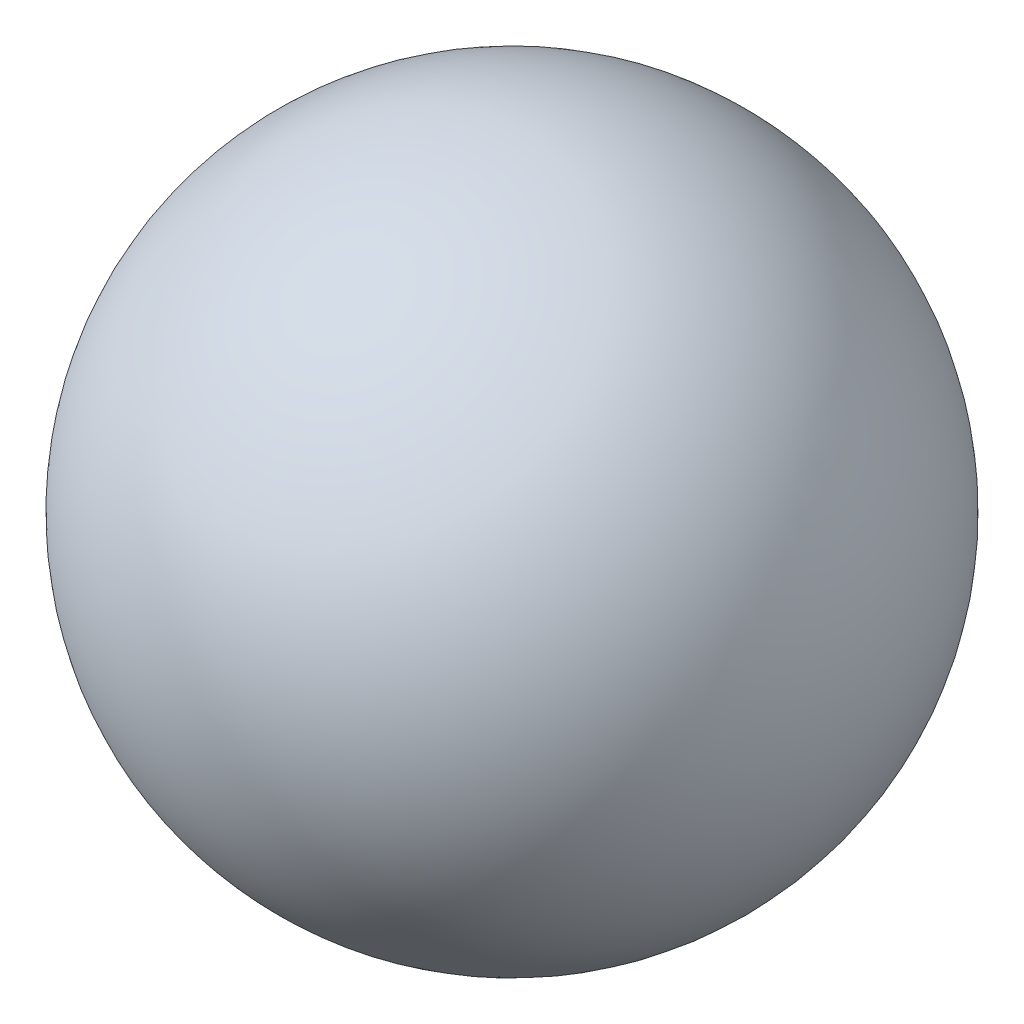
ISO-10303-21;
HEADER;
FILE_DESCRIPTION(('STEP AP214'),'2;1');
FILE_NAME('part.step','',(''),(''),'','','');
FILE_SCHEMA(('AUTOMOTIVE_DESIGN { 1 0 10303 214 1 1 1 1 }'));
ENDSEC;
DATA;
#1=APPLICATION_CONTEXT('core data for automotive mechanical design processes');
#2=APPLICATION_PROTOCOL_DEFINITION('international standard','automotive_design',2000,#1);
#3=PRODUCT_CONTEXT('',#1,'mechanical');
#4=PRODUCT('Part','Part','',(#3));
#5=PRODUCT_RELATED_PRODUCT_CATEGORY('part','',(#4));
#6=PRODUCT_DEFINITION_FORMATION('','',#4);
#7=PRODUCT_DEFINITION_CONTEXT('part definition',#1,'design');
#8=PRODUCT_DEFINITION('design','',#6,#7);
#9=PRODUCT_DEFINITION_SHAPE('','',#8);
#10=(LENGTH_UNIT() NAMED_UNIT(*) SI_UNIT(.MILLI.,.METRE.));
#11=(NAMED_UNIT(*) PLANE_ANGLE_UNIT() SI_UNIT($,.RADIAN.));
#12=(NAMED_UNIT(*) SI_UNIT($,.STERADIAN.) SOLID_ANGLE_UNIT());
#13=UNCERTAINTY_MEASURE_WITH_UNIT(LENGTH_MEASURE(1.E-05),#10,'distance_accuracy_value','');
#14=(GEOMETRIC_REPRESENTATION_CONTEXT(3) GLOBAL_UNCERTAINTY_ASSIGNED_CONTEXT((#13)) GLOBAL_UNIT_ASSIGNED_CONTEXT((#10,
#11,#12)) REPRESENTATION_CONTEXT('',''));
#15=CARTESIAN_POINT('',(0.,0.,0.));
#16=DIRECTION('',(0.,0.,1.));
#17=DIRECTION('',(1.,0.,0.));
#18=AXIS2_PLACEMENT_3D('',#15,#16,#17);
#19=CARTESIAN_POINT('',(5.19615242270659,-3.00000000000078,2.));
#20=DIRECTION('',(-0.500000000000011,-0.866025403784433,0.));
#21=DIRECTION('',(0.,0.,-1.));
#22=AXIS2_PLACEMENT_3D('',#19,#20,#21);
#23=SPHERICAL_SURFACE('',#22,1.04);
#24=CARTESIAN_POINT('',(5.7161524227066,-2.09933358006497,2.));
#25=VERTEX_POINT('',#24);
#26=VERTEX_LOOP('',#25);
#27=FACE_BOUND('',#26,.T.);
#28=ADVANCED_FACE('F15',(#27),#23,.T.);
#29=CLOSED_SHELL('',(#28));
#30=MANIFOLD_SOLID_BREP('B1',#29);
#31=ADVANCED_BREP_SHAPE_REPRESENTATION('',(#18,#30),#14);
#32=SHAPE_DEFINITION_REPRESENTATION(#9,#31);
ENDSEC;
END-ISO-10303-21;
